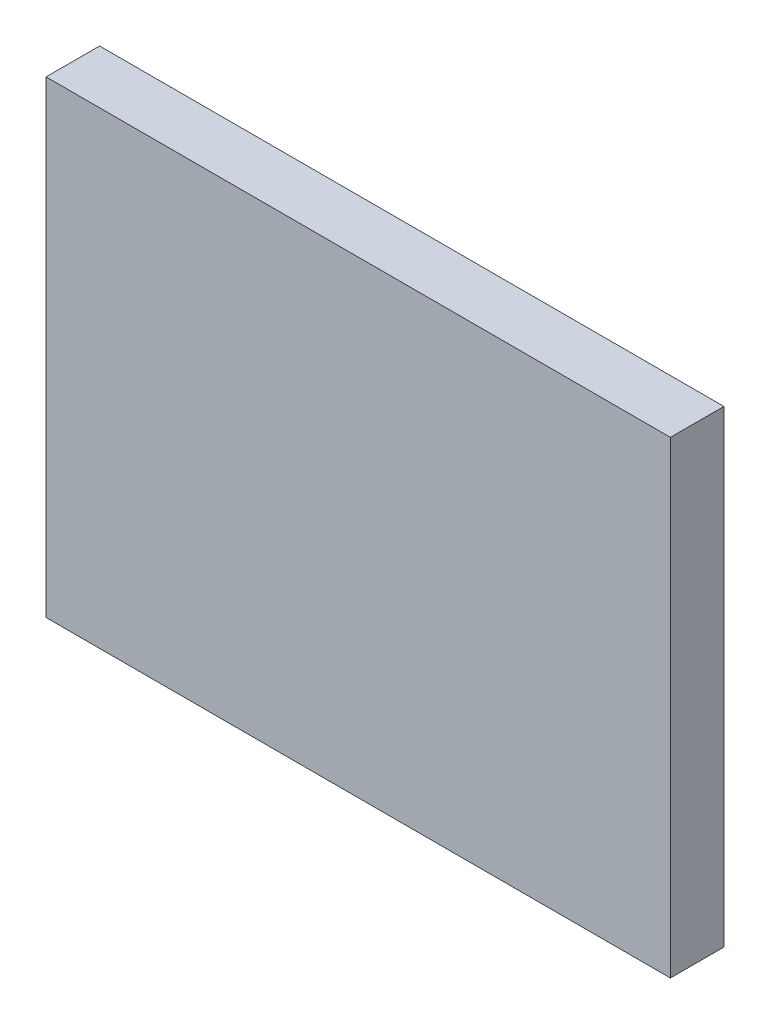
ISO-10303-21;
HEADER;
FILE_DESCRIPTION(('STEP AP214'),'2;1');
FILE_NAME('part.step','',(''),(''),'','','');
FILE_SCHEMA(('AUTOMOTIVE_DESIGN { 1 0 10303 214 1 1 1 1 }'));
ENDSEC;
DATA;
#1=APPLICATION_CONTEXT('core data for automotive mechanical design processes');
#2=APPLICATION_PROTOCOL_DEFINITION('international standard','automotive_design',2000,#1);
#3=PRODUCT_CONTEXT('',#1,'mechanical');
#4=PRODUCT('Part','Part','',(#3));
#5=PRODUCT_RELATED_PRODUCT_CATEGORY('part','',(#4));
#6=PRODUCT_DEFINITION_FORMATION('','',#4);
#7=PRODUCT_DEFINITION_CONTEXT('part definition',#1,'design');
#8=PRODUCT_DEFINITION('design','',#6,#7);
#9=PRODUCT_DEFINITION_SHAPE('','',#8);
#10=(LENGTH_UNIT() NAMED_UNIT(*) SI_UNIT(.MILLI.,.METRE.));
#11=(NAMED_UNIT(*) PLANE_ANGLE_UNIT() SI_UNIT($,.RADIAN.));
#12=(NAMED_UNIT(*) SI_UNIT($,.STERADIAN.) SOLID_ANGLE_UNIT());
#13=UNCERTAINTY_MEASURE_WITH_UNIT(LENGTH_MEASURE(1.E-05),#10,'distance_accuracy_value','');
#14=(GEOMETRIC_REPRESENTATION_CONTEXT(3) GLOBAL_UNCERTAINTY_ASSIGNED_CONTEXT((#13)) GLOBAL_UNIT_ASSIGNED_CONTEXT((#10,
#11,#12)) REPRESENTATION_CONTEXT('',''));
#15=CARTESIAN_POINT('',(0.,0.,0.));
#16=DIRECTION('',(0.,0.,1.));
#17=DIRECTION('',(1.,0.,0.));
#18=AXIS2_PLACEMENT_3D('',#15,#16,#17);
#19=CARTESIAN_POINT('',(2.5146,8.505108,0.76487));
#20=DIRECTION('',(0.,0.,-1.));
#21=DIRECTION('',(0.,1.,0.));
#22=AXIS2_PLACEMENT_3D('',#19,#20,#21);
#23=PLANE('',#22);
#24=DIRECTION('',(1.,0.,0.));
#25=VECTOR('',#24,1.);
#26=CARTESIAN_POINT('',(2.3146,8.655108,0.76487));
#27=LINE('',#26,#25);
#28=CARTESIAN_POINT('',(2.3146,8.655108,0.76487));
#29=VERTEX_POINT('',#28);
#30=CARTESIAN_POINT('',(2.7146,8.655108,0.76487));
#31=VERTEX_POINT('',#30);
#32=EDGE_CURVE('E55',#29,#31,#27,.T.);
#33=ORIENTED_EDGE('',*,*,#32,.T.);
#34=DIRECTION('',(0.,1.,0.));
#35=VECTOR('',#34,1.);
#36=CARTESIAN_POINT('',(2.7146,8.655108,0.76487));
#37=LINE('',#36,#35);
#38=CARTESIAN_POINT('',(2.7146,8.355108,0.76487));
#39=VERTEX_POINT('',#38);
#40=EDGE_CURVE('E57',#31,#39,#37,.F.);
#41=ORIENTED_EDGE('',*,*,#40,.T.);
#42=DIRECTION('',(1.,0.,0.));
#43=VECTOR('',#42,1.);
#44=CARTESIAN_POINT('',(2.7146,8.355108,0.76487));
#45=LINE('',#44,#43);
#46=CARTESIAN_POINT('',(2.3146,8.355108,0.76487));
#47=VERTEX_POINT('',#46);
#48=EDGE_CURVE('E20',#39,#47,#45,.F.);
#49=ORIENTED_EDGE('',*,*,#48,.T.);
#50=DIRECTION('',(0.,1.,0.));
#51=VECTOR('',#50,1.);
#52=CARTESIAN_POINT('',(2.3146,8.355108,0.76487));
#53=LINE('',#52,#51);
#54=EDGE_CURVE('E80',#47,#29,#53,.T.);
#55=ORIENTED_EDGE('',*,*,#54,.T.);
#56=EDGE_LOOP('',(#33,#41,#49,#55));
#57=FACE_BOUND('',#56,.T.);
#58=ADVANCED_FACE('F17',(#57),#23,.T.);
#59=CARTESIAN_POINT('',(2.7146,8.355108,0.76487));
#60=DIRECTION('',(0.,1.,0.));
#61=DIRECTION('',(0.,0.,1.));
#62=AXIS2_PLACEMENT_3D('',#59,#60,#61);
#63=PLANE('',#62);
#64=DIRECTION('',(0.,0.,-1.));
#65=VECTOR('',#64,1.);
#66=CARTESIAN_POINT('',(2.3146,8.355108,0.76487));
#67=LINE('',#66,#65);
#68=CARTESIAN_POINT('',(2.3146,8.355108,0.79916));
#69=VERTEX_POINT('',#68);
#70=EDGE_CURVE('E68',#69,#47,#67,.T.);
#71=ORIENTED_EDGE('',*,*,#70,.T.);
#72=ORIENTED_EDGE('',*,*,#48,.F.);
#73=DIRECTION('',(0.,0.,1.));
#74=VECTOR('',#73,1.);
#75=CARTESIAN_POINT('',(2.7146,8.355108,0.76487));
#76=LINE('',#75,#74);
#77=CARTESIAN_POINT('',(2.7146,8.355108,0.79916));
#78=VERTEX_POINT('',#77);
#79=EDGE_CURVE('E63',#39,#78,#76,.T.);
#80=ORIENTED_EDGE('',*,*,#79,.T.);
#81=DIRECTION('',(1.,0.,0.));
#82=VECTOR('',#81,1.);
#83=CARTESIAN_POINT('',(2.5146,8.355108,0.79916));
#84=LINE('',#83,#82);
#85=EDGE_CURVE('E83',#69,#78,#84,.T.);
#86=ORIENTED_EDGE('',*,*,#85,.F.);
#87=EDGE_LOOP('',(#71,#72,#80,#86));
#88=FACE_BOUND('',#87,.T.);
#89=ADVANCED_FACE('F65',(#88),#63,.F.);
#90=CARTESIAN_POINT('',(2.7146,8.655108,0.76487));
#91=DIRECTION('',(-1.,0.,0.));
#92=DIRECTION('',(0.,0.,1.));
#93=AXIS2_PLACEMENT_3D('',#90,#91,#92);
#94=PLANE('',#93);
#95=ORIENTED_EDGE('',*,*,#79,.F.);
#96=ORIENTED_EDGE('',*,*,#40,.F.);
#97=DIRECTION('',(0.,0.,-1.));
#98=VECTOR('',#97,1.);
#99=CARTESIAN_POINT('',(2.7146,8.655108,0.76487));
#100=LINE('',#99,#98);
#101=CARTESIAN_POINT('',(2.7146,8.655108,0.79916));
#102=VERTEX_POINT('',#101);
#103=EDGE_CURVE('E75',#31,#102,#100,.F.);
#104=ORIENTED_EDGE('',*,*,#103,.T.);
#105=DIRECTION('',(0.,-1.,0.));
#106=VECTOR('',#105,1.);
#107=CARTESIAN_POINT('',(2.7146,8.505108,0.79916));
#108=LINE('',#107,#106);
#109=EDGE_CURVE('E72',#78,#102,#108,.F.);
#110=ORIENTED_EDGE('',*,*,#109,.F.);
#111=EDGE_LOOP('',(#95,#96,#104,#110));
#112=FACE_BOUND('',#111,.T.);
#113=ADVANCED_FACE('F70',(#112),#94,.F.);
#114=CARTESIAN_POINT('',(2.3146,8.655108,0.76487));
#115=DIRECTION('',(0.,-1.,0.));
#116=DIRECTION('',(0.,0.,-1.));
#117=AXIS2_PLACEMENT_3D('',#114,#115,#116);
#118=PLANE('',#117);
#119=ORIENTED_EDGE('',*,*,#103,.F.);
#120=ORIENTED_EDGE('',*,*,#32,.F.);
#121=DIRECTION('',(0.,0.,-1.));
#122=VECTOR('',#121,1.);
#123=CARTESIAN_POINT('',(2.3146,8.655108,0.76487));
#124=LINE('',#123,#122);
#125=CARTESIAN_POINT('',(2.3146,8.655108,0.79916));
#126=VERTEX_POINT('',#125);
#127=EDGE_CURVE('E35',#29,#126,#124,.F.);
#128=ORIENTED_EDGE('',*,*,#127,.T.);
#129=DIRECTION('',(1.,0.,0.));
#130=VECTOR('',#129,1.);
#131=CARTESIAN_POINT('',(2.5146,8.655108,0.79916));
#132=LINE('',#131,#130);
#133=EDGE_CURVE('E26',#102,#126,#132,.F.);
#134=ORIENTED_EDGE('',*,*,#133,.F.);
#135=EDGE_LOOP('',(#119,#120,#128,#134));
#136=FACE_BOUND('',#135,.T.);
#137=ADVANCED_FACE('F89',(#136),#118,.F.);
#138=CARTESIAN_POINT('',(2.3146,8.355108,0.76487));
#139=DIRECTION('',(1.,0.,0.));
#140=DIRECTION('',(0.,0.,-1.));
#141=AXIS2_PLACEMENT_3D('',#138,#139,#140);
#142=PLANE('',#141);
#143=ORIENTED_EDGE('',*,*,#127,.F.);
#144=ORIENTED_EDGE('',*,*,#54,.F.);
#145=ORIENTED_EDGE('',*,*,#70,.F.);
#146=DIRECTION('',(0.,-1.,0.));
#147=VECTOR('',#146,1.);
#148=CARTESIAN_POINT('',(2.3146,8.505108,0.79916));
#149=LINE('',#148,#147);
#150=EDGE_CURVE('E11',#126,#69,#149,.T.);
#151=ORIENTED_EDGE('',*,*,#150,.F.);
#152=EDGE_LOOP('',(#143,#144,#145,#151));
#153=FACE_BOUND('',#152,.T.);
#154=ADVANCED_FACE('F91',(#153),#142,.F.);
#155=CARTESIAN_POINT('',(2.5146,8.505108,0.79916));
#156=DIRECTION('',(0.,0.,1.));
#157=DIRECTION('',(0.,-1.,0.));
#158=AXIS2_PLACEMENT_3D('',#155,#156,#157);
#159=PLANE('',#158);
#160=ORIENTED_EDGE('',*,*,#133,.T.);
#161=ORIENTED_EDGE('',*,*,#150,.T.);
#162=ORIENTED_EDGE('',*,*,#85,.T.);
#163=ORIENTED_EDGE('',*,*,#109,.T.);
#164=EDGE_LOOP('',(#160,#161,#162,#163));
#165=FACE_BOUND('',#164,.T.);
#166=ADVANCED_FACE('F88',(#165),#159,.T.);
#167=CLOSED_SHELL('',(#58,#89,#113,#137,#154,#166));
#168=MANIFOLD_SOLID_BREP('B1',#167);
#169=ADVANCED_BREP_SHAPE_REPRESENTATION('',(#18,#168),#14);
#170=SHAPE_DEFINITION_REPRESENTATION(#9,#169);
ENDSEC;
END-ISO-10303-21;
